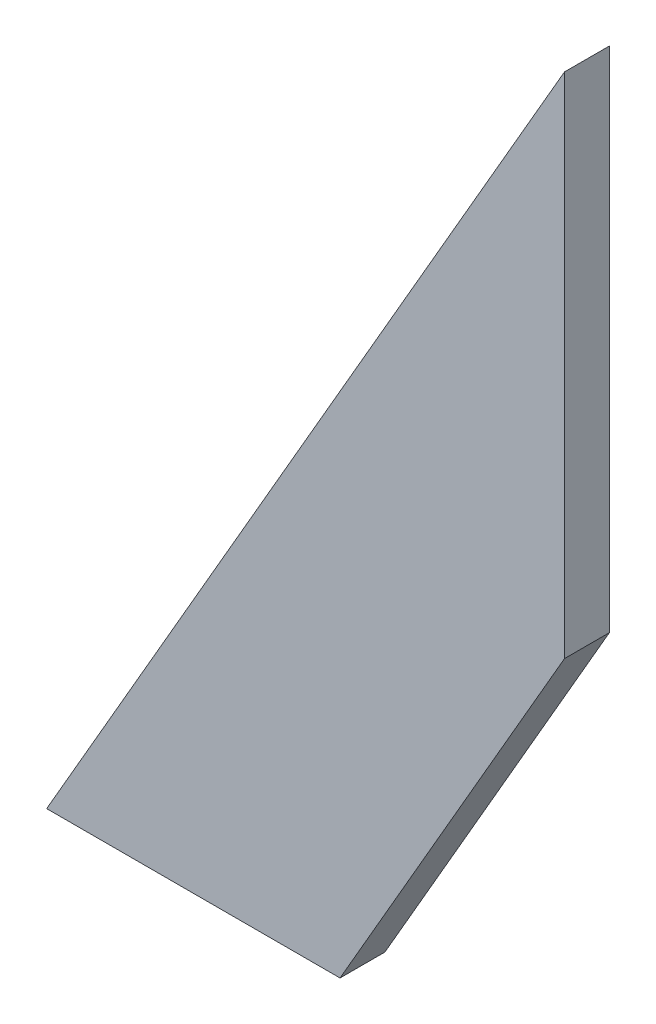
ISO-10303-21;
HEADER;
FILE_DESCRIPTION(('STEP AP214'),'2;1');
FILE_NAME('part.step','',(''),(''),'','','');
FILE_SCHEMA(('AUTOMOTIVE_DESIGN { 1 0 10303 214 1 1 1 1 }'));
ENDSEC;
DATA;
#1=APPLICATION_CONTEXT('core data for automotive mechanical design processes');
#2=APPLICATION_PROTOCOL_DEFINITION('international standard','automotive_design',2000,#1);
#3=PRODUCT_CONTEXT('',#1,'mechanical');
#4=PRODUCT('Part','Part','',(#3));
#5=PRODUCT_RELATED_PRODUCT_CATEGORY('part','',(#4));
#6=PRODUCT_DEFINITION_FORMATION('','',#4);
#7=PRODUCT_DEFINITION_CONTEXT('part definition',#1,'design');
#8=PRODUCT_DEFINITION('design','',#6,#7);
#9=PRODUCT_DEFINITION_SHAPE('','',#8);
#10=(LENGTH_UNIT() NAMED_UNIT(*) SI_UNIT(.MILLI.,.METRE.));
#11=(NAMED_UNIT(*) PLANE_ANGLE_UNIT() SI_UNIT($,.RADIAN.));
#12=(NAMED_UNIT(*) SI_UNIT($,.STERADIAN.) SOLID_ANGLE_UNIT());
#13=UNCERTAINTY_MEASURE_WITH_UNIT(LENGTH_MEASURE(1.E-05),#10,'distance_accuracy_value','');
#14=(GEOMETRIC_REPRESENTATION_CONTEXT(3) GLOBAL_UNCERTAINTY_ASSIGNED_CONTEXT((#13)) GLOBAL_UNIT_ASSIGNED_CONTEXT((#10,
#11,#12)) REPRESENTATION_CONTEXT('',''));
#15=CARTESIAN_POINT('',(0.,0.,0.));
#16=DIRECTION('',(0.,0.,1.));
#17=DIRECTION('',(1.,0.,0.));
#18=AXIS2_PLACEMENT_3D('',#15,#16,#17);
#19=CARTESIAN_POINT('',(-293.304420647238,200.545305077205,3.));
#20=DIRECTION('',(0.866025403784438,-0.500000000000001,0.));
#21=DIRECTION('',(0.500000000000001,0.866025403784438,0.));
#22=AXIS2_PLACEMENT_3D('',#19,#20,#21);
#23=PLANE('',#22);
#24=DIRECTION('',(-0.500000000000001,-0.866025403784438,0.));
#25=VECTOR('',#24,1.);
#26=CARTESIAN_POINT('',(-293.304420647238,200.545305077205,0.));
#27=LINE('',#26,#25);
#28=CARTESIAN_POINT('',(-258.656795040905,260.556752988997,0.));
#29=VERTEX_POINT('',#28);
#30=CARTESIAN_POINT('',(-293.304420647238,200.545305077205,0.));
#31=VERTEX_POINT('',#30);
#32=EDGE_CURVE('E100',#29,#31,#27,.T.);
#33=ORIENTED_EDGE('',*,*,#32,.T.);
#34=DIRECTION('',(0.,0.,-1.));
#35=VECTOR('',#34,1.);
#36=CARTESIAN_POINT('',(-293.304420647238,200.545305077205,3.));
#37=LINE('',#36,#35);
#38=CARTESIAN_POINT('',(-293.304420647238,200.545305077205,3.));
#39=VERTEX_POINT('',#38);
#40=EDGE_CURVE('E11',#39,#31,#37,.T.);
#41=ORIENTED_EDGE('',*,*,#40,.F.);
#42=DIRECTION('',(-0.500000000000001,-0.866025403784438,0.));
#43=VECTOR('',#42,1.);
#44=CARTESIAN_POINT('',(-293.304420647238,200.545305077205,3.));
#45=LINE('',#44,#43);
#46=CARTESIAN_POINT('',(-258.656795040905,260.556752988997,3.));
#47=VERTEX_POINT('',#46);
#48=EDGE_CURVE('E88',#47,#39,#45,.T.);
#49=ORIENTED_EDGE('',*,*,#48,.F.);
#50=DIRECTION('',(0.,0.,-1.));
#51=VECTOR('',#50,1.);
#52=CARTESIAN_POINT('',(-258.656795040905,260.556752988997,3.));
#53=LINE('',#52,#51);
#54=EDGE_CURVE('E96',#47,#29,#53,.T.);
#55=ORIENTED_EDGE('',*,*,#54,.T.);
#56=EDGE_LOOP('',(#33,#41,#49,#55));
#57=FACE_BOUND('',#56,.T.);
#58=ADVANCED_FACE('F37',(#57),#23,.F.);
#59=CARTESIAN_POINT('',(-273.676029688171,200.545305077205,3.));
#60=DIRECTION('',(0.,1.,0.));
#61=DIRECTION('',(0.,0.,1.));
#62=AXIS2_PLACEMENT_3D('',#59,#60,#61);
#63=PLANE('',#62);
#64=DIRECTION('',(1.,0.,0.));
#65=VECTOR('',#64,1.);
#66=CARTESIAN_POINT('',(-273.676029688171,200.545305077205,0.));
#67=LINE('',#66,#65);
#68=CARTESIAN_POINT('',(-273.676029688171,200.545305077205,0.));
#69=VERTEX_POINT('',#68);
#70=EDGE_CURVE('E92',#31,#69,#67,.T.);
#71=ORIENTED_EDGE('',*,*,#70,.T.);
#72=DIRECTION('',(0.,0.,-1.));
#73=VECTOR('',#72,1.);
#74=CARTESIAN_POINT('',(-273.676029688171,200.545305077205,3.));
#75=LINE('',#74,#73);
#76=CARTESIAN_POINT('',(-273.676029688171,200.545305077205,3.));
#77=VERTEX_POINT('',#76);
#78=EDGE_CURVE('E45',#77,#69,#75,.T.);
#79=ORIENTED_EDGE('',*,*,#78,.F.);
#80=DIRECTION('',(1.,0.,0.));
#81=VECTOR('',#80,1.);
#82=CARTESIAN_POINT('',(-273.676029688171,200.545305077205,3.));
#83=LINE('',#82,#81);
#84=EDGE_CURVE('E83',#39,#77,#83,.T.);
#85=ORIENTED_EDGE('',*,*,#84,.F.);
#86=ORIENTED_EDGE('',*,*,#40,.T.);
#87=EDGE_LOOP('',(#71,#79,#85,#86));
#88=FACE_BOUND('',#87,.T.);
#89=ADVANCED_FACE('F91',(#88),#63,.F.);
#90=CARTESIAN_POINT('',(-258.656795040905,226.562169330933,3.));
#91=DIRECTION('',(-0.866048594197572,0.49995983087485,0.));
#92=DIRECTION('',(-0.499959830874851,-0.866048594197572,0.));
#93=AXIS2_PLACEMENT_3D('',#90,#91,#92);
#94=PLANE('',#93);
#95=DIRECTION('',(0.49995983087485,0.866048594197572,0.));
#96=VECTOR('',#95,1.);
#97=CARTESIAN_POINT('',(-258.656795040905,226.562169330933,0.));
#98=LINE('',#97,#96);
#99=CARTESIAN_POINT('',(-258.656795040905,226.562169330933,0.));
#100=VERTEX_POINT('',#99);
#101=EDGE_CURVE('E70',#69,#100,#98,.T.);
#102=ORIENTED_EDGE('',*,*,#101,.T.);
#103=DIRECTION('',(0.,0.,-1.));
#104=VECTOR('',#103,1.);
#105=CARTESIAN_POINT('',(-258.656795040905,226.562169330933,3.));
#106=LINE('',#105,#104);
#107=CARTESIAN_POINT('',(-258.656795040905,226.562169330933,3.));
#108=VERTEX_POINT('',#107);
#109=EDGE_CURVE('E93',#108,#100,#106,.T.);
#110=ORIENTED_EDGE('',*,*,#109,.F.);
#111=DIRECTION('',(0.49995983087485,0.866048594197572,0.));
#112=VECTOR('',#111,1.);
#113=CARTESIAN_POINT('',(-258.656795040905,226.562169330933,3.));
#114=LINE('',#113,#112);
#115=EDGE_CURVE('E86',#77,#108,#114,.T.);
#116=ORIENTED_EDGE('',*,*,#115,.F.);
#117=ORIENTED_EDGE('',*,*,#78,.T.);
#118=EDGE_LOOP('',(#102,#110,#116,#117));
#119=FACE_BOUND('',#118,.T.);
#120=ADVANCED_FACE('F94',(#119),#94,.F.);
#121=CARTESIAN_POINT('',(-258.656795040905,260.556752988997,3.));
#122=DIRECTION('',(-1.,0.,0.));
#123=DIRECTION('',(0.,0.,1.));
#124=AXIS2_PLACEMENT_3D('',#121,#122,#123);
#125=PLANE('',#124);
#126=DIRECTION('',(0.,1.,0.));
#127=VECTOR('',#126,1.);
#128=CARTESIAN_POINT('',(-258.656795040905,260.556752988997,0.));
#129=LINE('',#128,#127);
#130=EDGE_CURVE('E76',#100,#29,#129,.T.);
#131=ORIENTED_EDGE('',*,*,#130,.T.);
#132=ORIENTED_EDGE('',*,*,#54,.F.);
#133=DIRECTION('',(0.,1.,0.));
#134=VECTOR('',#133,1.);
#135=CARTESIAN_POINT('',(-258.656795040905,260.556752988997,3.));
#136=LINE('',#135,#134);
#137=EDGE_CURVE('E53',#108,#47,#136,.T.);
#138=ORIENTED_EDGE('',*,*,#137,.F.);
#139=ORIENTED_EDGE('',*,*,#109,.T.);
#140=EDGE_LOOP('',(#131,#132,#138,#139));
#141=FACE_BOUND('',#140,.T.);
#142=ADVANCED_FACE('F107',(#141),#125,.F.);
#143=CARTESIAN_POINT('',(0.,0.,3.));
#144=DIRECTION('',(0.,0.,1.));
#145=DIRECTION('',(1.,0.,0.));
#146=AXIS2_PLACEMENT_3D('',#143,#144,#145);
#147=PLANE('',#146);
#148=ORIENTED_EDGE('',*,*,#48,.T.);
#149=ORIENTED_EDGE('',*,*,#84,.T.);
#150=ORIENTED_EDGE('',*,*,#115,.T.);
#151=ORIENTED_EDGE('',*,*,#137,.T.);
#152=EDGE_LOOP('',(#148,#149,#150,#151));
#153=FACE_BOUND('',#152,.T.);
#154=ADVANCED_FACE('F84',(#153),#147,.T.);
#155=CARTESIAN_POINT('',(0.,0.,0.));
#156=DIRECTION('',(0.,0.,1.));
#157=DIRECTION('',(1.,0.,0.));
#158=AXIS2_PLACEMENT_3D('',#155,#156,#157);
#159=PLANE('',#158);
#160=ORIENTED_EDGE('',*,*,#32,.F.);
#161=ORIENTED_EDGE('',*,*,#130,.F.);
#162=ORIENTED_EDGE('',*,*,#101,.F.);
#163=ORIENTED_EDGE('',*,*,#70,.F.);
#164=EDGE_LOOP('',(#160,#161,#162,#163));
#165=FACE_BOUND('',#164,.T.);
#166=ADVANCED_FACE('F110',(#165),#159,.F.);
#167=CLOSED_SHELL('',(#58,#89,#120,#142,#154,#166));
#168=MANIFOLD_SOLID_BREP('B2',#167);
#169=ADVANCED_BREP_SHAPE_REPRESENTATION('',(#18,#168),#14);
#170=SHAPE_DEFINITION_REPRESENTATION(#9,#169);
ENDSEC;
END-ISO-10303-21;
